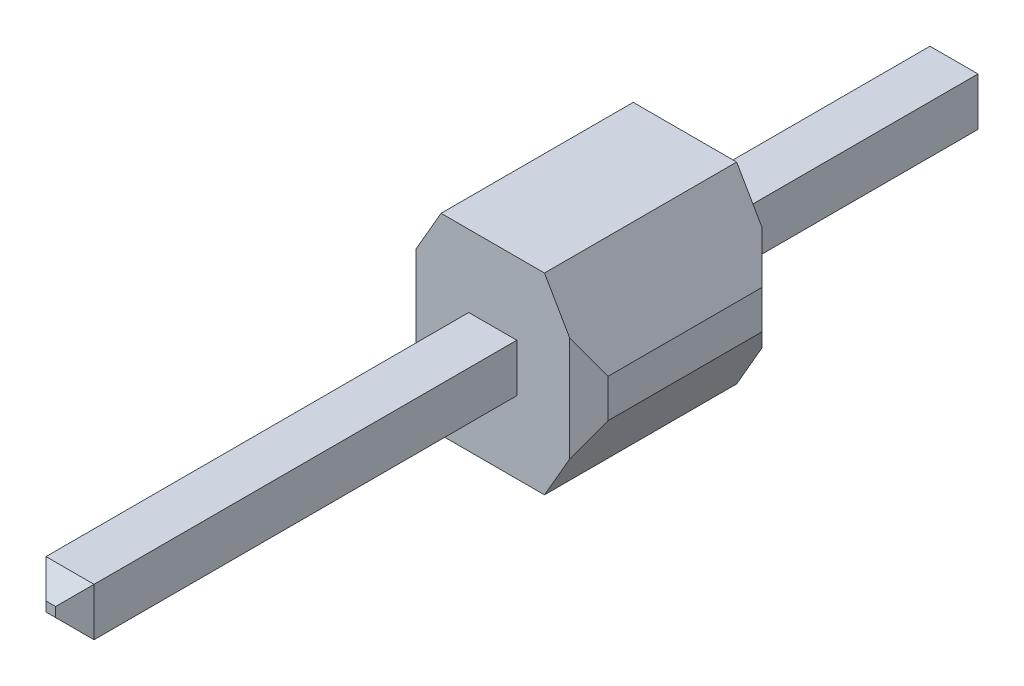
ISO-10303-21;
HEADER;
FILE_DESCRIPTION(('STEP AP214'),'2;1');
FILE_NAME('part.step','',(''),(''),'','','');
FILE_SCHEMA(('AUTOMOTIVE_DESIGN { 1 0 10303 214 1 1 1 1 }'));
ENDSEC;
DATA;
#1=APPLICATION_CONTEXT('core data for automotive mechanical design processes');
#2=APPLICATION_PROTOCOL_DEFINITION('international standard','automotive_design',2000,#1);
#3=PRODUCT_CONTEXT('',#1,'mechanical');
#4=PRODUCT('Part','Part','',(#3));
#5=PRODUCT_RELATED_PRODUCT_CATEGORY('part','',(#4));
#6=PRODUCT_DEFINITION_FORMATION('','',#4);
#7=PRODUCT_DEFINITION_CONTEXT('part definition',#1,'design');
#8=PRODUCT_DEFINITION('design','',#6,#7);
#9=PRODUCT_DEFINITION_SHAPE('','',#8);
#10=(LENGTH_UNIT() NAMED_UNIT(*) SI_UNIT(.MILLI.,.METRE.));
#11=(NAMED_UNIT(*) PLANE_ANGLE_UNIT() SI_UNIT($,.RADIAN.));
#12=(NAMED_UNIT(*) SI_UNIT($,.STERADIAN.) SOLID_ANGLE_UNIT());
#13=UNCERTAINTY_MEASURE_WITH_UNIT(LENGTH_MEASURE(1.E-05),#10,'distance_accuracy_value','');
#14=(GEOMETRIC_REPRESENTATION_CONTEXT(3) GLOBAL_UNCERTAINTY_ASSIGNED_CONTEXT((#13)) GLOBAL_UNIT_ASSIGNED_CONTEXT((#10,
#11,#12)) REPRESENTATION_CONTEXT('',''));
#15=CARTESIAN_POINT('',(0.,0.,0.));
#16=DIRECTION('',(0.,0.,1.));
#17=DIRECTION('',(1.,0.,0.));
#18=AXIS2_PLACEMENT_3D('',#15,#16,#17);
#19=CARTESIAN_POINT('',(-1.27,-1.27,2.54));
#20=DIRECTION('',(0.,0.,1.));
#21=DIRECTION('',(1.,0.,0.));
#22=AXIS2_PLACEMENT_3D('',#19,#20,#21);
#23=PLANE('',#22);
#24=DIRECTION('',(0.,1.,0.));
#25=VECTOR('',#24,1.);
#26=CARTESIAN_POINT('',(1.016,1.27,2.54));
#27=LINE('',#26,#25);
#28=CARTESIAN_POINT('',(1.016,-0.693940905122492,2.54));
#29=VERTEX_POINT('',#28);
#30=CARTESIAN_POINT('',(1.016,0.693940905122491,2.54));
#31=VERTEX_POINT('',#30);
#32=EDGE_CURVE('E237',#29,#31,#27,.T.);
#33=ORIENTED_EDGE('',*,*,#32,.T.);
#34=DIRECTION('',(0.500000000000006,-0.866025403784435,0.));
#35=VECTOR('',#34,1.);
#36=CARTESIAN_POINT('',(1.29491135768373,0.210852262806253,2.54));
#37=LINE('',#36,#35);
#38=CARTESIAN_POINT('',(0.683412126503329,1.27,2.54));
#39=VERTEX_POINT('',#38);
#40=EDGE_CURVE('E304',#31,#39,#37,.F.);
#41=ORIENTED_EDGE('',*,*,#40,.T.);
#42=DIRECTION('',(-1.,0.,0.));
#43=VECTOR('',#42,1.);
#44=CARTESIAN_POINT('',(-1.27,1.27,2.54));
#45=LINE('',#44,#43);
#46=CARTESIAN_POINT('',(-0.683412126503329,1.27,2.54));
#47=VERTEX_POINT('',#46);
#48=EDGE_CURVE('E234',#39,#47,#45,.T.);
#49=ORIENTED_EDGE('',*,*,#48,.T.);
#50=DIRECTION('',(0.500000000000005,0.866025403784435,0.));
#51=VECTOR('',#50,1.);
#52=CARTESIAN_POINT('',(-1.92991135768375,-0.888999999999993,2.54));
#53=LINE('',#52,#51);
#54=CARTESIAN_POINT('',(-1.016,0.693940905122492,2.54));
#55=VERTEX_POINT('',#54);
#56=EDGE_CURVE('E302',#47,#55,#53,.F.);
#57=ORIENTED_EDGE('',*,*,#56,.T.);
#58=DIRECTION('',(0.,-1.,0.));
#59=VECTOR('',#58,1.);
#60=CARTESIAN_POINT('',(-1.016,-1.27,2.54));
#61=LINE('',#60,#59);
#62=CARTESIAN_POINT('',(-1.016,-0.693940905122493,2.54));
#63=VERTEX_POINT('',#62);
#64=EDGE_CURVE('E240',#55,#63,#61,.T.);
#65=ORIENTED_EDGE('',*,*,#64,.T.);
#66=DIRECTION('',(-0.500000000000006,0.866025403784435,0.));
#67=VECTOR('',#66,1.);
#68=CARTESIAN_POINT('',(-0.8300590948775,-1.01599999999999,2.54));
#69=LINE('',#68,#67);
#70=CARTESIAN_POINT('',(-0.683412126503329,-1.27,2.54));
#71=VERTEX_POINT('',#70);
#72=EDGE_CURVE('E276',#63,#71,#69,.F.);
#73=ORIENTED_EDGE('',*,*,#72,.T.);
#74=DIRECTION('',(1.,0.,0.));
#75=VECTOR('',#74,1.);
#76=CARTESIAN_POINT('',(-1.27,-1.27,2.54));
#77=LINE('',#76,#75);
#78=CARTESIAN_POINT('',(0.683412126503329,-1.27,2.54));
#79=VERTEX_POINT('',#78);
#80=EDGE_CURVE('E231',#71,#79,#77,.T.);
#81=ORIENTED_EDGE('',*,*,#80,.T.);
#82=DIRECTION('',(-0.500000000000005,-0.866025403784436,0.));
#83=VECTOR('',#82,1.);
#84=CARTESIAN_POINT('',(0.195059094877487,-2.11585226280624,2.54));
#85=LINE('',#84,#83);
#86=EDGE_CURVE('E274',#79,#29,#85,.F.);
#87=ORIENTED_EDGE('',*,*,#86,.T.);
#88=EDGE_LOOP('',(#33,#41,#49,#57,#65,#73,#81,#87));
#89=FACE_BOUND('',#88,.T.);
#90=DIRECTION('',(1.,0.,0.));
#91=VECTOR('',#90,1.);
#92=CARTESIAN_POINT('',(-1.27,0.3175,2.54));
#93=LINE('',#92,#91);
#94=CARTESIAN_POINT('',(-0.3175,0.3175,2.54));
#95=VERTEX_POINT('',#94);
#96=CARTESIAN_POINT('',(0.3175,0.3175,2.54));
#97=VERTEX_POINT('',#96);
#98=EDGE_CURVE('E194',#95,#97,#93,.T.);
#99=ORIENTED_EDGE('',*,*,#98,.T.);
#100=DIRECTION('',(0.,-1.,0.));
#101=VECTOR('',#100,1.);
#102=CARTESIAN_POINT('',(0.3175,-1.27,2.54));
#103=LINE('',#102,#101);
#104=CARTESIAN_POINT('',(0.3175,-0.3175,2.54));
#105=VERTEX_POINT('',#104);
#106=EDGE_CURVE('E220',#97,#105,#103,.T.);
#107=ORIENTED_EDGE('',*,*,#106,.T.);
#108=DIRECTION('',(-1.,0.,0.));
#109=VECTOR('',#108,1.);
#110=CARTESIAN_POINT('',(-1.27,-0.3175,2.54));
#111=LINE('',#110,#109);
#112=CARTESIAN_POINT('',(-0.3175,-0.3175,2.54));
#113=VERTEX_POINT('',#112);
#114=EDGE_CURVE('E218',#105,#113,#111,.T.);
#115=ORIENTED_EDGE('',*,*,#114,.T.);
#116=DIRECTION('',(0.,1.,0.));
#117=VECTOR('',#116,1.);
#118=CARTESIAN_POINT('',(-0.3175,-1.27,2.54));
#119=LINE('',#118,#117);
#120=EDGE_CURVE('E205',#113,#95,#119,.T.);
#121=ORIENTED_EDGE('',*,*,#120,.T.);
#122=EDGE_LOOP('',(#99,#107,#115,#121));
#123=FACE_BOUND('',#122,.T.);
#124=ADVANCED_FACE('F34',(#89,#123),#23,.T.);
#125=CARTESIAN_POINT('',(-1.27,-1.27,0.));
#126=DIRECTION('',(0.,0.,1.));
#127=DIRECTION('',(1.,0.,0.));
#128=AXIS2_PLACEMENT_3D('',#125,#126,#127);
#129=PLANE('',#128);
#130=DIRECTION('',(-1.,0.,0.));
#131=VECTOR('',#130,1.);
#132=CARTESIAN_POINT('',(-1.27,1.27,0.));
#133=LINE('',#132,#131);
#134=CARTESIAN_POINT('',(0.683412126503329,1.27,0.));
#135=VERTEX_POINT('',#134);
#136=CARTESIAN_POINT('',(-0.683412126503329,1.27,0.));
#137=VERTEX_POINT('',#136);
#138=EDGE_CURVE('E228',#135,#137,#133,.T.);
#139=ORIENTED_EDGE('',*,*,#138,.F.);
#140=DIRECTION('',(-0.500000000000006,0.866025403784435,0.));
#141=VECTOR('',#140,1.);
#142=CARTESIAN_POINT('',(0.683412126503329,1.27,0.));
#143=LINE('',#142,#141);
#144=CARTESIAN_POINT('',(1.016,0.693940905122487,0.));
#145=VERTEX_POINT('',#144);
#146=EDGE_CURVE('E294',#135,#145,#143,.F.);
#147=ORIENTED_EDGE('',*,*,#146,.T.);
#148=DIRECTION('',(0.,-1.,0.));
#149=VECTOR('',#148,1.);
#150=CARTESIAN_POINT('',(1.016,-1.27,0.));
#151=LINE('',#150,#149);
#152=CARTESIAN_POINT('',(1.016,-0.693940905122488,0.));
#153=VERTEX_POINT('',#152);
#154=EDGE_CURVE('E249',#145,#153,#151,.T.);
#155=ORIENTED_EDGE('',*,*,#154,.T.);
#156=DIRECTION('',(0.500000000000005,0.866025403784436,0.));
#157=VECTOR('',#156,1.);
#158=CARTESIAN_POINT('',(1.27,-0.253999999999996,0.));
#159=LINE('',#158,#157);
#160=CARTESIAN_POINT('',(0.68341212650333,-1.27,0.));
#161=VERTEX_POINT('',#160);
#162=EDGE_CURVE('E262',#153,#161,#159,.F.);
#163=ORIENTED_EDGE('',*,*,#162,.T.);
#164=DIRECTION('',(1.,0.,0.));
#165=VECTOR('',#164,1.);
#166=CARTESIAN_POINT('',(-1.27,-1.27,0.));
#167=LINE('',#166,#165);
#168=CARTESIAN_POINT('',(-0.683412126503329,-1.27,0.));
#169=VERTEX_POINT('',#168);
#170=EDGE_CURVE('E225',#169,#161,#167,.T.);
#171=ORIENTED_EDGE('',*,*,#170,.F.);
#172=DIRECTION('',(0.500000000000006,-0.866025403784435,0.));
#173=VECTOR('',#172,1.);
#174=CARTESIAN_POINT('',(-0.683412126503329,-1.27,0.));
#175=LINE('',#174,#173);
#176=CARTESIAN_POINT('',(-1.016,-0.693940905122488,0.));
#177=VERTEX_POINT('',#176);
#178=EDGE_CURVE('E264',#169,#177,#175,.F.);
#179=ORIENTED_EDGE('',*,*,#178,.T.);
#180=DIRECTION('',(0.,1.,0.));
#181=VECTOR('',#180,1.);
#182=CARTESIAN_POINT('',(-1.016,-1.27,0.));
#183=LINE('',#182,#181);
#184=CARTESIAN_POINT('',(-1.016,0.693940905122488,0.));
#185=VERTEX_POINT('',#184);
#186=EDGE_CURVE('E251',#177,#185,#183,.T.);
#187=ORIENTED_EDGE('',*,*,#186,.T.);
#188=DIRECTION('',(-0.500000000000005,-0.866025403784435,0.));
#189=VECTOR('',#188,1.);
#190=CARTESIAN_POINT('',(-1.27,0.253999999999996,0.));
#191=LINE('',#190,#189);
#192=EDGE_CURVE('E292',#185,#137,#191,.F.);
#193=ORIENTED_EDGE('',*,*,#192,.T.);
#194=EDGE_LOOP('',(#139,#147,#155,#163,#171,#179,#187,#193));
#195=FACE_BOUND('',#194,.T.);
#196=DIRECTION('',(0.,-1.,0.));
#197=VECTOR('',#196,1.);
#198=CARTESIAN_POINT('',(0.3175,-1.27,0.));
#199=LINE('',#198,#197);
#200=CARTESIAN_POINT('',(0.3175,0.3175,0.));
#201=VERTEX_POINT('',#200);
#202=CARTESIAN_POINT('',(0.3175,-0.3175,0.));
#203=VERTEX_POINT('',#202);
#204=EDGE_CURVE('E322',#201,#203,#199,.T.);
#205=ORIENTED_EDGE('',*,*,#204,.F.);
#206=DIRECTION('',(1.,0.,0.));
#207=VECTOR('',#206,1.);
#208=CARTESIAN_POINT('',(-1.27,0.3175,0.));
#209=LINE('',#208,#207);
#210=CARTESIAN_POINT('',(-0.3175,0.3175,0.));
#211=VERTEX_POINT('',#210);
#212=EDGE_CURVE('E313',#211,#201,#209,.T.);
#213=ORIENTED_EDGE('',*,*,#212,.F.);
#214=DIRECTION('',(0.,1.,0.));
#215=VECTOR('',#214,1.);
#216=CARTESIAN_POINT('',(-0.3175,-1.27,0.));
#217=LINE('',#216,#215);
#218=CARTESIAN_POINT('',(-0.3175,-0.3175,0.));
#219=VERTEX_POINT('',#218);
#220=EDGE_CURVE('E316',#219,#211,#217,.T.);
#221=ORIENTED_EDGE('',*,*,#220,.F.);
#222=DIRECTION('',(-1.,0.,0.));
#223=VECTOR('',#222,1.);
#224=CARTESIAN_POINT('',(-1.27,-0.3175,0.));
#225=LINE('',#224,#223);
#226=EDGE_CURVE('E319',#203,#219,#225,.T.);
#227=ORIENTED_EDGE('',*,*,#226,.F.);
#228=EDGE_LOOP('',(#205,#213,#221,#227));
#229=FACE_BOUND('',#228,.T.);
#230=ADVANCED_FACE('F431',(#195,#229),#129,.F.);
#231=CARTESIAN_POINT('',(-1.27,1.27,2.54));
#232=DIRECTION('',(1.,0.,0.));
#233=DIRECTION('',(0.,1.,0.));
#234=AXIS2_PLACEMENT_3D('',#231,#232,#233);
#235=PLANE('',#234);
#236=DIRECTION('',(0.,1.,0.));
#237=VECTOR('',#236,1.);
#238=CARTESIAN_POINT('',(-1.27,1.27,2.286));
#239=LINE('',#238,#237);
#240=CARTESIAN_POINT('',(-1.27,-0.253999999999997,2.286));
#241=VERTEX_POINT('',#240);
#242=CARTESIAN_POINT('',(-1.27,0.253999999999996,2.286));
#243=VERTEX_POINT('',#242);
#244=EDGE_CURVE('E242',#241,#243,#239,.T.);
#245=ORIENTED_EDGE('',*,*,#244,.T.);
#246=DIRECTION('',(0.,0.,-1.));
#247=VECTOR('',#246,1.);
#248=CARTESIAN_POINT('',(-1.27,0.253999999999996,2.54));
#249=LINE('',#248,#247);
#250=CARTESIAN_POINT('',(-1.27,0.253999999999996,0.254000000000005));
#251=VERTEX_POINT('',#250);
#252=EDGE_CURVE('E306',#243,#251,#249,.T.);
#253=ORIENTED_EDGE('',*,*,#252,.T.);
#254=DIRECTION('',(0.,-1.,0.));
#255=VECTOR('',#254,1.);
#256=CARTESIAN_POINT('',(-1.27,1.27,0.254000000000005));
#257=LINE('',#256,#255);
#258=CARTESIAN_POINT('',(-1.27,-0.253999999999996,0.254000000000005));
#259=VERTEX_POINT('',#258);
#260=EDGE_CURVE('E247',#251,#259,#257,.T.);
#261=ORIENTED_EDGE('',*,*,#260,.T.);
#262=DIRECTION('',(0.,0.,1.));
#263=VECTOR('',#262,1.);
#264=CARTESIAN_POINT('',(-1.27,-0.253999999999996,2.54));
#265=LINE('',#264,#263);
#266=EDGE_CURVE('E269',#259,#241,#265,.T.);
#267=ORIENTED_EDGE('',*,*,#266,.T.);
#268=EDGE_LOOP('',(#245,#253,#261,#267));
#269=FACE_BOUND('',#268,.T.);
#270=ADVANCED_FACE('F36',(#269),#235,.F.);
#271=CARTESIAN_POINT('',(-1.27,-1.27,2.54));
#272=DIRECTION('',(0.,1.,0.));
#273=DIRECTION('',(0.,0.,1.));
#274=AXIS2_PLACEMENT_3D('',#271,#272,#273);
#275=PLANE('',#274);
#276=ORIENTED_EDGE('',*,*,#80,.F.);
#277=DIRECTION('',(0.,0.,-1.));
#278=VECTOR('',#277,1.);
#279=CARTESIAN_POINT('',(-0.683412126503329,-1.27,2.54));
#280=LINE('',#279,#278);
#281=EDGE_CURVE('E259',#71,#169,#280,.T.);
#282=ORIENTED_EDGE('',*,*,#281,.T.);
#283=ORIENTED_EDGE('',*,*,#170,.T.);
#284=DIRECTION('',(0.,0.,1.));
#285=VECTOR('',#284,1.);
#286=CARTESIAN_POINT('',(0.68341212650333,-1.27,2.54));
#287=LINE('',#286,#285);
#288=EDGE_CURVE('E257',#161,#79,#287,.T.);
#289=ORIENTED_EDGE('',*,*,#288,.T.);
#290=EDGE_LOOP('',(#276,#282,#283,#289));
#291=FACE_BOUND('',#290,.T.);
#292=ADVANCED_FACE('F448',(#291),#275,.F.);
#293=CARTESIAN_POINT('',(1.27,1.27,2.54));
#294=DIRECTION('',(-1.,0.,0.));
#295=DIRECTION('',(0.,-1.,0.));
#296=AXIS2_PLACEMENT_3D('',#293,#294,#295);
#297=PLANE('',#296);
#298=DIRECTION('',(0.,1.,0.));
#299=VECTOR('',#298,1.);
#300=CARTESIAN_POINT('',(1.27,1.27,0.254000000000005));
#301=LINE('',#300,#299);
#302=CARTESIAN_POINT('',(1.27,-0.253999999999996,0.254000000000005));
#303=VERTEX_POINT('',#302);
#304=CARTESIAN_POINT('',(1.27,0.253999999999996,0.254000000000005));
#305=VERTEX_POINT('',#304);
#306=EDGE_CURVE('E254',#303,#305,#301,.T.);
#307=ORIENTED_EDGE('',*,*,#306,.T.);
#308=DIRECTION('',(0.,0.,1.));
#309=VECTOR('',#308,1.);
#310=CARTESIAN_POINT('',(1.27,0.253999999999996,2.54));
#311=LINE('',#310,#309);
#312=CARTESIAN_POINT('',(1.27,0.253999999999996,2.286));
#313=VERTEX_POINT('',#312);
#314=EDGE_CURVE('E298',#305,#313,#311,.T.);
#315=ORIENTED_EDGE('',*,*,#314,.T.);
#316=DIRECTION('',(0.,-1.,0.));
#317=VECTOR('',#316,1.);
#318=CARTESIAN_POINT('',(1.27,-1.27,2.286));
#319=LINE('',#318,#317);
#320=CARTESIAN_POINT('',(1.27,-0.253999999999996,2.286));
#321=VERTEX_POINT('',#320);
#322=EDGE_CURVE('E245',#313,#321,#319,.T.);
#323=ORIENTED_EDGE('',*,*,#322,.T.);
#324=DIRECTION('',(0.,0.,-1.));
#325=VECTOR('',#324,1.);
#326=CARTESIAN_POINT('',(1.27,-0.253999999999996,2.54));
#327=LINE('',#326,#325);
#328=EDGE_CURVE('E278',#321,#303,#327,.T.);
#329=ORIENTED_EDGE('',*,*,#328,.T.);
#330=EDGE_LOOP('',(#307,#315,#323,#329));
#331=FACE_BOUND('',#330,.T.);
#332=ADVANCED_FACE('F445',(#331),#297,.F.);
#333=CARTESIAN_POINT('',(-1.27,1.27,2.54));
#334=DIRECTION('',(0.,-1.,0.));
#335=DIRECTION('',(0.,0.,-1.));
#336=AXIS2_PLACEMENT_3D('',#333,#334,#335);
#337=PLANE('',#336);
#338=ORIENTED_EDGE('',*,*,#48,.F.);
#339=DIRECTION('',(0.,0.,-1.));
#340=VECTOR('',#339,1.);
#341=CARTESIAN_POINT('',(0.683412126503329,1.27,2.54));
#342=LINE('',#341,#340);
#343=EDGE_CURVE('E289',#39,#135,#342,.T.);
#344=ORIENTED_EDGE('',*,*,#343,.T.);
#345=ORIENTED_EDGE('',*,*,#138,.T.);
#346=DIRECTION('',(0.,0.,1.));
#347=VECTOR('',#346,1.);
#348=CARTESIAN_POINT('',(-0.683412126503329,1.27,2.54));
#349=LINE('',#348,#347);
#350=EDGE_CURVE('E287',#137,#47,#349,.T.);
#351=ORIENTED_EDGE('',*,*,#350,.T.);
#352=EDGE_LOOP('',(#338,#344,#345,#351));
#353=FACE_BOUND('',#352,.T.);
#354=ADVANCED_FACE('F441',(#353),#337,.F.);
#355=CARTESIAN_POINT('',(-1.016,-1.27,2.54));
#356=DIRECTION('',(-0.707106781186543,0.,0.707106781186552));
#357=DIRECTION('',(0.707106781186552,0.,0.707106781186543));
#358=AXIS2_PLACEMENT_3D('',#355,#356,#357);
#359=PLANE('',#358);
#360=ORIENTED_EDGE('',*,*,#64,.F.);
#361=DIRECTION('',(0.447213595499963,0.774596669241481,0.447213595499957));
#362=VECTOR('',#361,1.);
#363=CARTESIAN_POINT('',(-1.69632908614699,-0.484423637950995,1.85967091385301));
#364=LINE('',#363,#362);
#365=EDGE_CURVE('E311',#55,#243,#364,.F.);
#366=ORIENTED_EDGE('',*,*,#365,.T.);
#367=ORIENTED_EDGE('',*,*,#244,.F.);
#368=DIRECTION('',(-0.447213595499963,0.774596669241481,-0.447213595499958));
#369=VECTOR('',#368,1.);
#370=CARTESIAN_POINT('',(-0.816447275901997,-1.03957636204899,2.739552724098));
#371=LINE('',#370,#369);
#372=EDGE_CURVE('E271',#241,#63,#371,.F.);
#373=ORIENTED_EDGE('',*,*,#372,.T.);
#374=EDGE_LOOP('',(#360,#366,#367,#373));
#375=FACE_BOUND('',#374,.T.);
#376=ADVANCED_FACE('F444',(#375),#359,.T.);
#377=CARTESIAN_POINT('',(1.016,-1.27,2.54));
#378=DIRECTION('',(0.707106781186544,0.,0.707106781186551));
#379=DIRECTION('',(0.707106781186551,0.,-0.707106781186544));
#380=AXIS2_PLACEMENT_3D('',#377,#378,#379);
#381=PLANE('',#380);
#382=ORIENTED_EDGE('',*,*,#322,.F.);
#383=DIRECTION('',(0.447213595499963,-0.77459666924148,-0.447213595499959));
#384=VECTOR('',#383,1.);
#385=CARTESIAN_POINT('',(1.69632908614699,-0.484423637950994,1.85967091385301));
#386=LINE('',#385,#384);
#387=EDGE_CURVE('E300',#313,#31,#386,.F.);
#388=ORIENTED_EDGE('',*,*,#387,.T.);
#389=ORIENTED_EDGE('',*,*,#32,.F.);
#390=DIRECTION('',(-0.447213595499963,-0.77459666924148,0.447213595499959));
#391=VECTOR('',#390,1.);
#392=CARTESIAN_POINT('',(0.816447275901998,-1.03957636204899,2.739552724098));
#393=LINE('',#392,#391);
#394=EDGE_CURVE('E284',#29,#321,#393,.F.);
#395=ORIENTED_EDGE('',*,*,#394,.T.);
#396=EDGE_LOOP('',(#382,#388,#389,#395));
#397=FACE_BOUND('',#396,.T.);
#398=ADVANCED_FACE('F503',(#397),#381,.T.);
#399=CARTESIAN_POINT('',(-1.27,1.27,0.254000000000005));
#400=DIRECTION('',(0.707106781186551,0.,0.707106781186544));
#401=DIRECTION('',(0.707106781186544,0.,-0.707106781186551));
#402=AXIS2_PLACEMENT_3D('',#399,#400,#401);
#403=PLANE('',#402);
#404=ORIENTED_EDGE('',*,*,#260,.F.);
#405=DIRECTION('',(0.447213595499961,0.774596669241477,-0.447213595499965));
#406=VECTOR('',#405,1.);
#407=CARTESIAN_POINT('',(-0.918047275902003,0.863599999999989,-0.0979527240979958));
#408=LINE('',#407,#406);
#409=EDGE_CURVE('E309',#251,#185,#408,.T.);
#410=ORIENTED_EDGE('',*,*,#409,.T.);
#411=ORIENTED_EDGE('',*,*,#186,.F.);
#412=DIRECTION('',(-0.447213595499961,0.774596669241477,0.447213595499966));
#413=VECTOR('',#412,1.);
#414=CARTESIAN_POINT('',(-1.79792908614699,0.660399999999987,0.781929086147002));
#415=LINE('',#414,#413);
#416=EDGE_CURVE('E266',#177,#259,#415,.T.);
#417=ORIENTED_EDGE('',*,*,#416,.T.);
#418=EDGE_LOOP('',(#404,#410,#411,#417));
#419=FACE_BOUND('',#418,.T.);
#420=ADVANCED_FACE('F473',(#419),#403,.F.);
#421=CARTESIAN_POINT('',(1.27,1.27,0.254000000000005));
#422=DIRECTION('',(-0.707106781186552,0.,0.707106781186543));
#423=DIRECTION('',(0.707106781186543,0.,0.707106781186552));
#424=AXIS2_PLACEMENT_3D('',#421,#422,#423);
#425=PLANE('',#424);
#426=ORIENTED_EDGE('',*,*,#154,.F.);
#427=DIRECTION('',(0.447213595499961,-0.774596669241477,0.447213595499967));
#428=VECTOR('',#427,1.);
#429=CARTESIAN_POINT('',(0.918047275902004,0.863599999999988,-0.0979527240979965));
#430=LINE('',#429,#428);
#431=EDGE_CURVE('E296',#145,#305,#430,.T.);
#432=ORIENTED_EDGE('',*,*,#431,.T.);
#433=ORIENTED_EDGE('',*,*,#306,.F.);
#434=DIRECTION('',(-0.447213595499961,-0.774596669241477,-0.447213595499967));
#435=VECTOR('',#434,1.);
#436=CARTESIAN_POINT('',(1.79792908614699,0.660399999999987,0.781929086147003));
#437=LINE('',#436,#435);
#438=EDGE_CURVE('E281',#303,#153,#437,.T.);
#439=ORIENTED_EDGE('',*,*,#438,.T.);
#440=EDGE_LOOP('',(#426,#432,#433,#439));
#441=FACE_BOUND('',#440,.T.);
#442=ADVANCED_FACE('F493',(#441),#425,.F.);
#443=CARTESIAN_POINT('',(-0.683412126503329,-1.27,2.54));
#444=DIRECTION('',(0.866025403784435,0.500000000000006,0.));
#445=DIRECTION('',(-0.500000000000006,0.866025403784435,0.));
#446=AXIS2_PLACEMENT_3D('',#443,#444,#445);
#447=PLANE('',#446);
#448=ORIENTED_EDGE('',*,*,#372,.F.);
#449=ORIENTED_EDGE('',*,*,#266,.F.);
#450=ORIENTED_EDGE('',*,*,#416,.F.);
#451=ORIENTED_EDGE('',*,*,#178,.F.);
#452=ORIENTED_EDGE('',*,*,#281,.F.);
#453=ORIENTED_EDGE('',*,*,#72,.F.);
#454=EDGE_LOOP('',(#448,#449,#450,#451,#452,#453));
#455=FACE_BOUND('',#454,.T.);
#456=ADVANCED_FACE('F464',(#455),#447,.F.);
#457=CARTESIAN_POINT('',(1.27,-0.253999999999996,2.54));
#458=DIRECTION('',(-0.866025403784435,0.500000000000005,0.));
#459=DIRECTION('',(-0.500000000000005,-0.866025403784436,0.));
#460=AXIS2_PLACEMENT_3D('',#457,#458,#459);
#461=PLANE('',#460);
#462=ORIENTED_EDGE('',*,*,#86,.F.);
#463=ORIENTED_EDGE('',*,*,#288,.F.);
#464=ORIENTED_EDGE('',*,*,#162,.F.);
#465=ORIENTED_EDGE('',*,*,#438,.F.);
#466=ORIENTED_EDGE('',*,*,#328,.F.);
#467=ORIENTED_EDGE('',*,*,#394,.F.);
#468=EDGE_LOOP('',(#462,#463,#464,#465,#466,#467));
#469=FACE_BOUND('',#468,.T.);
#470=ADVANCED_FACE('F498',(#469),#461,.F.);
#471=CARTESIAN_POINT('',(0.683412126503329,1.27,2.54));
#472=DIRECTION('',(-0.866025403784435,-0.500000000000006,0.));
#473=DIRECTION('',(0.500000000000006,-0.866025403784435,0.));
#474=AXIS2_PLACEMENT_3D('',#471,#472,#473);
#475=PLANE('',#474);
#476=ORIENTED_EDGE('',*,*,#387,.F.);
#477=ORIENTED_EDGE('',*,*,#314,.F.);
#478=ORIENTED_EDGE('',*,*,#431,.F.);
#479=ORIENTED_EDGE('',*,*,#146,.F.);
#480=ORIENTED_EDGE('',*,*,#343,.F.);
#481=ORIENTED_EDGE('',*,*,#40,.F.);
#482=EDGE_LOOP('',(#476,#477,#478,#479,#480,#481));
#483=FACE_BOUND('',#482,.T.);
#484=ADVANCED_FACE('F488',(#483),#475,.F.);
#485=CARTESIAN_POINT('',(-1.27,0.253999999999996,2.54));
#486=DIRECTION('',(0.866025403784435,-0.500000000000005,0.));
#487=DIRECTION('',(0.500000000000005,0.866025403784435,0.));
#488=AXIS2_PLACEMENT_3D('',#485,#486,#487);
#489=PLANE('',#488);
#490=ORIENTED_EDGE('',*,*,#56,.F.);
#491=ORIENTED_EDGE('',*,*,#350,.F.);
#492=ORIENTED_EDGE('',*,*,#192,.F.);
#493=ORIENTED_EDGE('',*,*,#409,.F.);
#494=ORIENTED_EDGE('',*,*,#252,.F.);
#495=ORIENTED_EDGE('',*,*,#365,.F.);
#496=EDGE_LOOP('',(#490,#491,#492,#493,#494,#495));
#497=FACE_BOUND('',#496,.T.);
#498=ADVANCED_FACE('F477',(#497),#489,.F.);
#499=CARTESIAN_POINT('',(0.3175,0.3175,-3.81));
#500=DIRECTION('',(0.,0.,-1.));
#501=DIRECTION('',(-1.,0.,0.));
#502=AXIS2_PLACEMENT_3D('',#499,#500,#501);
#503=PLANE('',#502);
#504=DIRECTION('',(0.,-1.,0.));
#505=VECTOR('',#504,1.);
#506=CARTESIAN_POINT('',(0.0634999999999957,-0.3175,-3.81));
#507=LINE('',#506,#505);
#508=CARTESIAN_POINT('',(0.0634999999999958,0.0634999999999957,-3.81));
#509=VERTEX_POINT('',#508);
#510=CARTESIAN_POINT('',(0.0634999999999957,-0.0634999999999958,-3.81));
#511=VERTEX_POINT('',#510);
#512=EDGE_CURVE('E346',#509,#511,#507,.T.);
#513=ORIENTED_EDGE('',*,*,#512,.T.);
#514=DIRECTION('',(-1.,0.,0.));
#515=VECTOR('',#514,1.);
#516=CARTESIAN_POINT('',(-0.3175,-0.0634999999999958,-3.81));
#517=LINE('',#516,#515);
#518=CARTESIAN_POINT('',(-0.0634999999999958,-0.0634999999999958,-3.81));
#519=VERTEX_POINT('',#518);
#520=EDGE_CURVE('E348',#511,#519,#517,.T.);
#521=ORIENTED_EDGE('',*,*,#520,.T.);
#522=DIRECTION('',(0.,1.,0.));
#523=VECTOR('',#522,1.);
#524=CARTESIAN_POINT('',(-0.0634999999999958,0.3175,-3.81));
#525=LINE('',#524,#523);
#526=CARTESIAN_POINT('',(-0.0634999999999958,0.0634999999999958,-3.81));
#527=VERTEX_POINT('',#526);
#528=EDGE_CURVE('E344',#519,#527,#525,.T.);
#529=ORIENTED_EDGE('',*,*,#528,.T.);
#530=DIRECTION('',(1.,0.,0.));
#531=VECTOR('',#530,1.);
#532=CARTESIAN_POINT('',(0.3175,0.0634999999999957,-3.81));
#533=LINE('',#532,#531);
#534=EDGE_CURVE('E342',#527,#509,#533,.T.);
#535=ORIENTED_EDGE('',*,*,#534,.T.);
#536=EDGE_LOOP('',(#513,#521,#529,#535));
#537=FACE_BOUND('',#536,.T.);
#538=ADVANCED_FACE('F520',(#537),#503,.T.);
#539=CARTESIAN_POINT('',(-0.3175,0.3175,-3.81));
#540=DIRECTION('',(0.,-1.,0.));
#541=DIRECTION('',(1.,0.,0.));
#542=AXIS2_PLACEMENT_3D('',#539,#540,#541);
#543=PLANE('',#542);
#544=DIRECTION('',(0.,0.,1.));
#545=VECTOR('',#544,1.);
#546=CARTESIAN_POINT('',(0.3175,0.3175,-3.81));
#547=LINE('',#546,#545);
#548=CARTESIAN_POINT('',(0.3175,0.3175,-3.556));
#549=VERTEX_POINT('',#548);
#550=EDGE_CURVE('E215',#549,#201,#547,.T.);
#551=ORIENTED_EDGE('',*,*,#550,.F.);
#552=DIRECTION('',(-1.,0.,0.));
#553=VECTOR('',#552,1.);
#554=CARTESIAN_POINT('',(-0.3175,0.3175,-3.556));
#555=LINE('',#554,#553);
#556=CARTESIAN_POINT('',(-0.3175,0.3175,-3.556));
#557=VERTEX_POINT('',#556);
#558=EDGE_CURVE('E11',#549,#557,#555,.T.);
#559=ORIENTED_EDGE('',*,*,#558,.T.);
#560=DIRECTION('',(0.,0.,1.));
#561=VECTOR('',#560,1.);
#562=CARTESIAN_POINT('',(-0.3175,0.3175,-3.81));
#563=LINE('',#562,#561);
#564=EDGE_CURVE('E214',#557,#211,#563,.T.);
#565=ORIENTED_EDGE('',*,*,#564,.T.);
#566=ORIENTED_EDGE('',*,*,#212,.T.);
#567=EDGE_LOOP('',(#551,#559,#565,#566));
#568=FACE_BOUND('',#567,.T.);
#569=ADVANCED_FACE('F524',(#568),#543,.F.);
#570=CARTESIAN_POINT('',(-0.3175,-0.3175,-3.81));
#571=DIRECTION('',(1.,0.,0.));
#572=DIRECTION('',(0.,0.,-1.));
#573=AXIS2_PLACEMENT_3D('',#570,#571,#572);
#574=PLANE('',#573);
#575=ORIENTED_EDGE('',*,*,#564,.F.);
#576=DIRECTION('',(0.,-1.,0.));
#577=VECTOR('',#576,1.);
#578=CARTESIAN_POINT('',(-0.3175,-0.3175,-3.556));
#579=LINE('',#578,#577);
#580=CARTESIAN_POINT('',(-0.3175,-0.3175,-3.556));
#581=VERTEX_POINT('',#580);
#582=EDGE_CURVE('E42',#557,#581,#579,.T.);
#583=ORIENTED_EDGE('',*,*,#582,.T.);
#584=DIRECTION('',(0.,0.,1.));
#585=VECTOR('',#584,1.);
#586=CARTESIAN_POINT('',(-0.3175,-0.3175,-3.81));
#587=LINE('',#586,#585);
#588=EDGE_CURVE('E358',#581,#219,#587,.T.);
#589=ORIENTED_EDGE('',*,*,#588,.T.);
#590=ORIENTED_EDGE('',*,*,#220,.T.);
#591=EDGE_LOOP('',(#575,#583,#589,#590));
#592=FACE_BOUND('',#591,.T.);
#593=ADVANCED_FACE('F357',(#592),#574,.F.);
#594=CARTESIAN_POINT('',(-0.3175,-0.3175,-3.81));
#595=DIRECTION('',(0.,1.,0.));
#596=DIRECTION('',(-1.,0.,0.));
#597=AXIS2_PLACEMENT_3D('',#594,#595,#596);
#598=PLANE('',#597);
#599=ORIENTED_EDGE('',*,*,#588,.F.);
#600=DIRECTION('',(1.,0.,0.));
#601=VECTOR('',#600,1.);
#602=CARTESIAN_POINT('',(0.3175,-0.3175,-3.556));
#603=LINE('',#602,#601);
#604=CARTESIAN_POINT('',(0.3175,-0.3175,-3.556));
#605=VERTEX_POINT('',#604);
#606=EDGE_CURVE('E351',#581,#605,#603,.T.);
#607=ORIENTED_EDGE('',*,*,#606,.T.);
#608=DIRECTION('',(0.,0.,1.));
#609=VECTOR('',#608,1.);
#610=CARTESIAN_POINT('',(0.3175,-0.3175,-3.81));
#611=LINE('',#610,#609);
#612=EDGE_CURVE('E206',#605,#203,#611,.T.);
#613=ORIENTED_EDGE('',*,*,#612,.T.);
#614=ORIENTED_EDGE('',*,*,#226,.T.);
#615=EDGE_LOOP('',(#599,#607,#613,#614));
#616=FACE_BOUND('',#615,.T.);
#617=ADVANCED_FACE('F366',(#616),#598,.F.);
#618=CARTESIAN_POINT('',(0.3175,-0.3175,-3.81));
#619=DIRECTION('',(-1.,0.,0.));
#620=DIRECTION('',(0.,-1.,0.));
#621=AXIS2_PLACEMENT_3D('',#618,#619,#620);
#622=PLANE('',#621);
#623=ORIENTED_EDGE('',*,*,#612,.F.);
#624=DIRECTION('',(0.,1.,0.));
#625=VECTOR('',#624,1.);
#626=CARTESIAN_POINT('',(0.3175,0.3175,-3.556));
#627=LINE('',#626,#625);
#628=EDGE_CURVE('E55',#605,#549,#627,.T.);
#629=ORIENTED_EDGE('',*,*,#628,.T.);
#630=ORIENTED_EDGE('',*,*,#550,.T.);
#631=ORIENTED_EDGE('',*,*,#204,.T.);
#632=EDGE_LOOP('',(#623,#629,#630,#631));
#633=FACE_BOUND('',#632,.T.);
#634=ADVANCED_FACE('F422',(#633),#622,.F.);
#635=CARTESIAN_POINT('',(0.3175,0.3175,8.128));
#636=VERTEX_POINT('',#635);
#637=EDGE_CURVE('E200',#97,#636,#547,.T.);
#638=ORIENTED_EDGE('',*,*,#637,.T.);
#639=DIRECTION('',(0.,-1.,0.));
#640=VECTOR('',#639,1.);
#641=CARTESIAN_POINT('',(0.3175,-0.3175,8.128));
#642=LINE('',#641,#640);
#643=CARTESIAN_POINT('',(0.3175,-0.3175,8.128));
#644=VERTEX_POINT('',#643);
#645=EDGE_CURVE('E340',#636,#644,#642,.T.);
#646=ORIENTED_EDGE('',*,*,#645,.T.);
#647=EDGE_CURVE('E368',#105,#644,#611,.T.);
#648=ORIENTED_EDGE('',*,*,#647,.F.);
#649=ORIENTED_EDGE('',*,*,#106,.F.);
#650=EDGE_LOOP('',(#638,#646,#648,#649));
#651=FACE_BOUND('',#650,.T.);
#652=ADVANCED_FACE('F420',(#651),#622,.F.);
#653=ORIENTED_EDGE('',*,*,#647,.T.);
#654=DIRECTION('',(-1.,0.,0.));
#655=VECTOR('',#654,1.);
#656=CARTESIAN_POINT('',(-0.3175,-0.3175,8.128));
#657=LINE('',#656,#655);
#658=CARTESIAN_POINT('',(-0.3175,-0.3175,8.128));
#659=VERTEX_POINT('',#658);
#660=EDGE_CURVE('E325',#644,#659,#657,.T.);
#661=ORIENTED_EDGE('',*,*,#660,.T.);
#662=EDGE_CURVE('E369',#113,#659,#587,.T.);
#663=ORIENTED_EDGE('',*,*,#662,.F.);
#664=ORIENTED_EDGE('',*,*,#114,.F.);
#665=EDGE_LOOP('',(#653,#661,#663,#664));
#666=FACE_BOUND('',#665,.T.);
#667=ADVANCED_FACE('F401',(#666),#598,.F.);
#668=ORIENTED_EDGE('',*,*,#662,.T.);
#669=DIRECTION('',(0.,1.,0.));
#670=VECTOR('',#669,1.);
#671=CARTESIAN_POINT('',(-0.3175,-0.3175,8.128));
#672=LINE('',#671,#670);
#673=CARTESIAN_POINT('',(-0.3175,0.3175,8.128));
#674=VERTEX_POINT('',#673);
#675=EDGE_CURVE('E213',#659,#674,#672,.T.);
#676=ORIENTED_EDGE('',*,*,#675,.T.);
#677=EDGE_CURVE('E197',#95,#674,#563,.T.);
#678=ORIENTED_EDGE('',*,*,#677,.F.);
#679=ORIENTED_EDGE('',*,*,#120,.F.);
#680=EDGE_LOOP('',(#668,#676,#678,#679));
#681=FACE_BOUND('',#680,.T.);
#682=ADVANCED_FACE('F210',(#681),#574,.F.);
#683=ORIENTED_EDGE('',*,*,#677,.T.);
#684=DIRECTION('',(1.,0.,0.));
#685=VECTOR('',#684,1.);
#686=CARTESIAN_POINT('',(-0.3175,0.3175,8.128));
#687=LINE('',#686,#685);
#688=EDGE_CURVE('E338',#674,#636,#687,.T.);
#689=ORIENTED_EDGE('',*,*,#688,.T.);
#690=ORIENTED_EDGE('',*,*,#637,.F.);
#691=ORIENTED_EDGE('',*,*,#98,.F.);
#692=EDGE_LOOP('',(#683,#689,#690,#691));
#693=FACE_BOUND('',#692,.T.);
#694=ADVANCED_FACE('F196',(#693),#543,.F.);
#695=CARTESIAN_POINT('',(0.3175,0.3175,8.382));
#696=DIRECTION('',(0.,0.,-1.));
#697=DIRECTION('',(-1.,0.,0.));
#698=AXIS2_PLACEMENT_3D('',#695,#696,#697);
#699=PLANE('',#698);
#700=DIRECTION('',(0.,-1.,0.));
#701=VECTOR('',#700,1.);
#702=CARTESIAN_POINT('',(-0.0634999999999958,0.3175,8.382));
#703=LINE('',#702,#701);
#704=CARTESIAN_POINT('',(-0.0634999999999958,0.0634999999999958,8.382));
#705=VERTEX_POINT('',#704);
#706=CARTESIAN_POINT('',(-0.0634999999999958,-0.0634999999999958,8.382));
#707=VERTEX_POINT('',#706);
#708=EDGE_CURVE('E332',#705,#707,#703,.T.);
#709=ORIENTED_EDGE('',*,*,#708,.T.);
#710=DIRECTION('',(1.,0.,0.));
#711=VECTOR('',#710,1.);
#712=CARTESIAN_POINT('',(0.3175,-0.0634999999999959,8.382));
#713=LINE('',#712,#711);
#714=CARTESIAN_POINT('',(0.0634999999999957,-0.0634999999999958,8.382));
#715=VERTEX_POINT('',#714);
#716=EDGE_CURVE('E334',#707,#715,#713,.T.);
#717=ORIENTED_EDGE('',*,*,#716,.T.);
#718=DIRECTION('',(0.,1.,0.));
#719=VECTOR('',#718,1.);
#720=CARTESIAN_POINT('',(0.0634999999999958,0.3175,8.382));
#721=LINE('',#720,#719);
#722=CARTESIAN_POINT('',(0.0634999999999958,0.0634999999999957,8.382));
#723=VERTEX_POINT('',#722);
#724=EDGE_CURVE('E328',#715,#723,#721,.T.);
#725=ORIENTED_EDGE('',*,*,#724,.T.);
#726=DIRECTION('',(-1.,0.,0.));
#727=VECTOR('',#726,1.);
#728=CARTESIAN_POINT('',(0.3175,0.0634999999999957,8.382));
#729=LINE('',#728,#727);
#730=EDGE_CURVE('E330',#723,#705,#729,.T.);
#731=ORIENTED_EDGE('',*,*,#730,.T.);
#732=EDGE_LOOP('',(#709,#717,#725,#731));
#733=FACE_BOUND('',#732,.T.);
#734=ADVANCED_FACE('F532',(#733),#699,.F.);
#735=CARTESIAN_POINT('',(-0.3175,0.3175,8.128));
#736=DIRECTION('',(0.,-0.707106781186545,-0.70710678118655));
#737=DIRECTION('',(0.,0.70710678118655,-0.707106781186545));
#738=AXIS2_PLACEMENT_3D('',#735,#736,#737);
#739=PLANE('',#738);
#740=DIRECTION('',(0.577350269189627,-0.577350269189627,0.577350269189623));
#741=VECTOR('',#740,1.);
#742=CARTESIAN_POINT('',(-0.3175,0.3175,8.128));
#743=LINE('',#742,#741);
#744=EDGE_CURVE('E391',#705,#674,#743,.F.);
#745=ORIENTED_EDGE('',*,*,#744,.F.);
#746=ORIENTED_EDGE('',*,*,#730,.F.);
#747=DIRECTION('',(-0.577350269189627,-0.577350269189627,0.577350269189623));
#748=VECTOR('',#747,1.);
#749=CARTESIAN_POINT('',(0.105833333333332,0.105833333333332,8.33966666666666));
#750=LINE('',#749,#748);
#751=EDGE_CURVE('E394',#636,#723,#750,.T.);
#752=ORIENTED_EDGE('',*,*,#751,.F.);
#753=ORIENTED_EDGE('',*,*,#688,.F.);
#754=EDGE_LOOP('',(#745,#746,#752,#753));
#755=FACE_BOUND('',#754,.T.);
#756=ADVANCED_FACE('F418',(#755),#739,.F.);
#757=CARTESIAN_POINT('',(0.3175,-0.3175,8.128));
#758=DIRECTION('',(-0.707106781186545,0.,-0.70710678118655));
#759=DIRECTION('',(-0.70710678118655,0.,0.707106781186545));
#760=AXIS2_PLACEMENT_3D('',#757,#758,#759);
#761=PLANE('',#760);
#762=ORIENTED_EDGE('',*,*,#751,.T.);
#763=ORIENTED_EDGE('',*,*,#724,.F.);
#764=DIRECTION('',(0.577350269189627,-0.577350269189627,-0.577350269189623));
#765=VECTOR('',#764,1.);
#766=CARTESIAN_POINT('',(0.3175,-0.3175,8.128));
#767=LINE('',#766,#765);
#768=EDGE_CURVE('E389',#644,#715,#767,.F.);
#769=ORIENTED_EDGE('',*,*,#768,.F.);
#770=ORIENTED_EDGE('',*,*,#645,.F.);
#771=EDGE_LOOP('',(#762,#763,#769,#770));
#772=FACE_BOUND('',#771,.T.);
#773=ADVANCED_FACE('F407',(#772),#761,.F.);
#774=CARTESIAN_POINT('',(-0.3175,-0.3175,8.128));
#775=DIRECTION('',(0.707106781186545,0.,-0.70710678118655));
#776=DIRECTION('',(-0.70710678118655,0.,-0.707106781186545));
#777=AXIS2_PLACEMENT_3D('',#774,#775,#776);
#778=PLANE('',#777);
#779=ORIENTED_EDGE('',*,*,#744,.T.);
#780=ORIENTED_EDGE('',*,*,#675,.F.);
#781=DIRECTION('',(0.577350269189627,0.577350269189627,0.577350269189623));
#782=VECTOR('',#781,1.);
#783=CARTESIAN_POINT('',(-0.3175,-0.3175,8.128));
#784=LINE('',#783,#782);
#785=EDGE_CURVE('E387',#707,#659,#784,.F.);
#786=ORIENTED_EDGE('',*,*,#785,.F.);
#787=ORIENTED_EDGE('',*,*,#708,.F.);
#788=EDGE_LOOP('',(#779,#780,#786,#787));
#789=FACE_BOUND('',#788,.T.);
#790=ADVANCED_FACE('F414',(#789),#778,.F.);
#791=CARTESIAN_POINT('',(-0.3175,-0.3175,8.128));
#792=DIRECTION('',(0.,0.707106781186545,-0.70710678118655));
#793=DIRECTION('',(0.,0.70710678118655,0.707106781186545));
#794=AXIS2_PLACEMENT_3D('',#791,#792,#793);
#795=PLANE('',#794);
#796=ORIENTED_EDGE('',*,*,#768,.T.);
#797=ORIENTED_EDGE('',*,*,#716,.F.);
#798=ORIENTED_EDGE('',*,*,#785,.T.);
#799=ORIENTED_EDGE('',*,*,#660,.F.);
#800=EDGE_LOOP('',(#796,#797,#798,#799));
#801=FACE_BOUND('',#800,.T.);
#802=ADVANCED_FACE('F410',(#801),#795,.F.);
#803=CARTESIAN_POINT('',(0.3175,0.0634999999999957,-3.81));
#804=DIRECTION('',(0.,0.707106781186544,-0.707106781186551));
#805=DIRECTION('',(0.,0.707106781186551,0.707106781186544));
#806=AXIS2_PLACEMENT_3D('',#803,#804,#805);
#807=PLANE('',#806);
#808=DIRECTION('',(-0.577350269189628,0.577350269189628,0.577350269189622));
#809=VECTOR('',#808,1.);
#810=CARTESIAN_POINT('',(0.0635000000000037,-0.0635000000000038,-3.937));
#811=LINE('',#810,#809);
#812=EDGE_CURVE('E380',#557,#527,#811,.F.);
#813=ORIENTED_EDGE('',*,*,#812,.F.);
#814=ORIENTED_EDGE('',*,*,#558,.F.);
#815=DIRECTION('',(-0.577350269189628,-0.577350269189628,-0.577350269189622));
#816=VECTOR('',#815,1.);
#817=CARTESIAN_POINT('',(0.148166666666664,0.148166666666664,-3.72533333333333));
#818=LINE('',#817,#816);
#819=EDGE_CURVE('E384',#509,#549,#818,.F.);
#820=ORIENTED_EDGE('',*,*,#819,.F.);
#821=ORIENTED_EDGE('',*,*,#534,.F.);
#822=EDGE_LOOP('',(#813,#814,#820,#821));
#823=FACE_BOUND('',#822,.T.);
#824=ADVANCED_FACE('F603',(#823),#807,.T.);
#825=CARTESIAN_POINT('',(0.0634999999999958,0.3175,-3.81));
#826=DIRECTION('',(0.707106781186544,0.,-0.707106781186551));
#827=DIRECTION('',(-0.707106781186551,0.,-0.707106781186544));
#828=AXIS2_PLACEMENT_3D('',#825,#826,#827);
#829=PLANE('',#828);
#830=ORIENTED_EDGE('',*,*,#819,.T.);
#831=ORIENTED_EDGE('',*,*,#628,.F.);
#832=DIRECTION('',(-0.577350269189628,0.577350269189628,-0.577350269189622));
#833=VECTOR('',#832,1.);
#834=CARTESIAN_POINT('',(-0.0635000000000037,0.0635000000000036,-3.937));
#835=LINE('',#834,#833);
#836=EDGE_CURVE('E377',#511,#605,#835,.F.);
#837=ORIENTED_EDGE('',*,*,#836,.F.);
#838=ORIENTED_EDGE('',*,*,#512,.F.);
#839=EDGE_LOOP('',(#830,#831,#837,#838));
#840=FACE_BOUND('',#839,.T.);
#841=ADVANCED_FACE('F612',(#840),#829,.T.);
#842=CARTESIAN_POINT('',(-0.0634999999999958,0.3175,-3.81));
#843=DIRECTION('',(-0.707106781186544,0.,-0.707106781186551));
#844=DIRECTION('',(-0.707106781186551,0.,0.707106781186544));
#845=AXIS2_PLACEMENT_3D('',#842,#843,#844);
#846=PLANE('',#845);
#847=ORIENTED_EDGE('',*,*,#812,.T.);
#848=ORIENTED_EDGE('',*,*,#528,.F.);
#849=DIRECTION('',(-0.577350269189628,-0.577350269189628,0.577350269189622));
#850=VECTOR('',#849,1.);
#851=CARTESIAN_POINT('',(0.0635000000000037,0.0635000000000036,-3.937));
#852=LINE('',#851,#850);
#853=EDGE_CURVE('E374',#581,#519,#852,.F.);
#854=ORIENTED_EDGE('',*,*,#853,.F.);
#855=ORIENTED_EDGE('',*,*,#582,.F.);
#856=EDGE_LOOP('',(#847,#848,#854,#855));
#857=FACE_BOUND('',#856,.T.);
#858=ADVANCED_FACE('F378',(#857),#846,.T.);
#859=CARTESIAN_POINT('',(0.3175,-0.0634999999999959,-3.81));
#860=DIRECTION('',(0.,-0.707106781186544,-0.707106781186551));
#861=DIRECTION('',(0.,0.707106781186551,-0.707106781186544));
#862=AXIS2_PLACEMENT_3D('',#859,#860,#861);
#863=PLANE('',#862);
#864=ORIENTED_EDGE('',*,*,#836,.T.);
#865=ORIENTED_EDGE('',*,*,#606,.F.);
#866=ORIENTED_EDGE('',*,*,#853,.T.);
#867=ORIENTED_EDGE('',*,*,#520,.F.);
#868=EDGE_LOOP('',(#864,#865,#866,#867));
#869=FACE_BOUND('',#868,.T.);
#870=ADVANCED_FACE('F372',(#869),#863,.T.);
#871=CLOSED_SHELL('',(#124,#230,#270,#292,#332,#354,#376,#398,#420,#442,#456,#470,#484,#498,
#538,#569,#593,#617,#634,#652,#667,#682,#694,#734,#756,#773,#790,#802,#824,#841,#858,#870));
#872=MANIFOLD_SOLID_BREP('B2',#871);
#873=ADVANCED_BREP_SHAPE_REPRESENTATION('',(#18,#872),#14);
#874=SHAPE_DEFINITION_REPRESENTATION(#9,#873);
ENDSEC;
END-ISO-10303-21;
